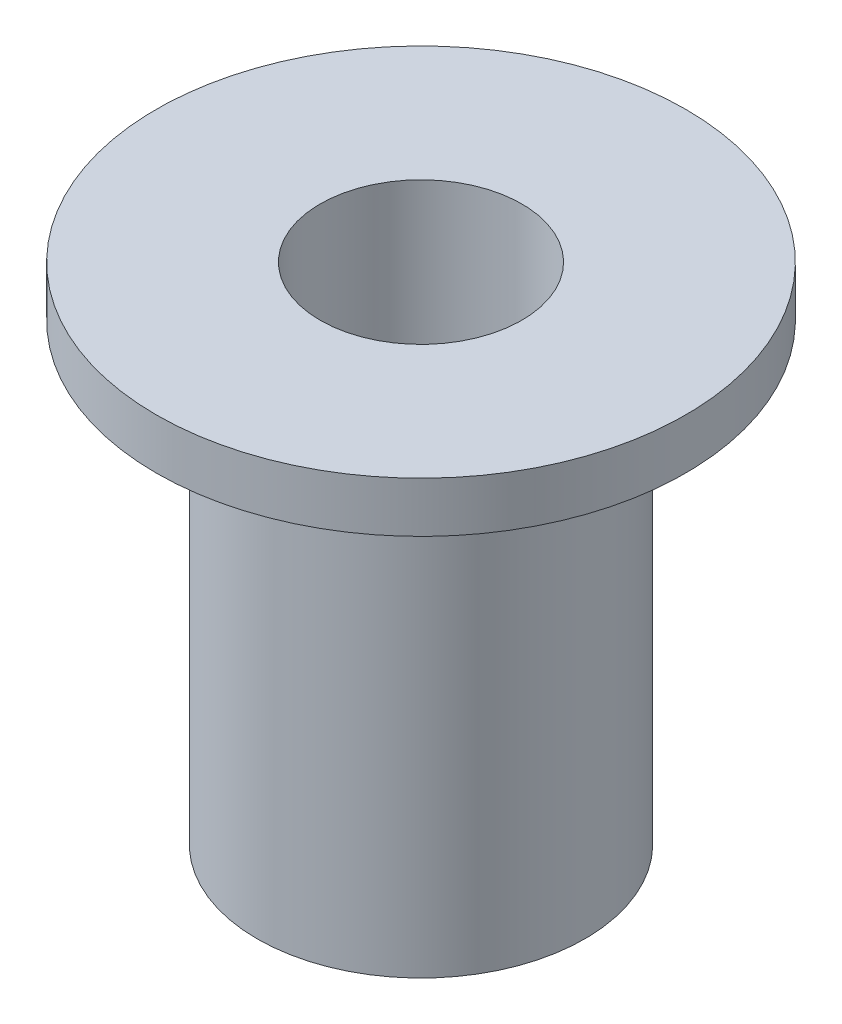
ISO-10303-21;
HEADER;
FILE_DESCRIPTION(('STEP AP214'),'2;1');
FILE_NAME('part.step','',(''),(''),'','','');
FILE_SCHEMA(('AUTOMOTIVE_DESIGN { 1 0 10303 214 1 1 1 1 }'));
ENDSEC;
DATA;
#1=APPLICATION_CONTEXT('core data for automotive mechanical design processes');
#2=APPLICATION_PROTOCOL_DEFINITION('international standard','automotive_design',2000,#1);
#3=PRODUCT_CONTEXT('',#1,'mechanical');
#4=PRODUCT('Part','Part','',(#3));
#5=PRODUCT_RELATED_PRODUCT_CATEGORY('part','',(#4));
#6=PRODUCT_DEFINITION_FORMATION('','',#4);
#7=PRODUCT_DEFINITION_CONTEXT('part definition',#1,'design');
#8=PRODUCT_DEFINITION('design','',#6,#7);
#9=PRODUCT_DEFINITION_SHAPE('','',#8);
#10=(LENGTH_UNIT() NAMED_UNIT(*) SI_UNIT(.MILLI.,.METRE.));
#11=(NAMED_UNIT(*) PLANE_ANGLE_UNIT() SI_UNIT($,.RADIAN.));
#12=(NAMED_UNIT(*) SI_UNIT($,.STERADIAN.) SOLID_ANGLE_UNIT());
#13=UNCERTAINTY_MEASURE_WITH_UNIT(LENGTH_MEASURE(1.E-05),#10,'distance_accuracy_value','');
#14=(GEOMETRIC_REPRESENTATION_CONTEXT(3) GLOBAL_UNCERTAINTY_ASSIGNED_CONTEXT((#13)) GLOBAL_UNIT_ASSIGNED_CONTEXT((#10,
#11,#12)) REPRESENTATION_CONTEXT('',''));
#15=CARTESIAN_POINT('',(0.,0.,0.));
#16=DIRECTION('',(0.,0.,1.));
#17=DIRECTION('',(1.,0.,0.));
#18=AXIS2_PLACEMENT_3D('',#15,#16,#17);
#19=CARTESIAN_POINT('',(0.,20.,0.));
#20=DIRECTION('',(0.,-1.,0.));
#21=DIRECTION('',(0.,0.,-1.));
#22=AXIS2_PLACEMENT_3D('',#19,#20,#21);
#23=CYLINDRICAL_SURFACE('',#22,6.5);
#24=CARTESIAN_POINT('',(0.,0.,0.));
#25=DIRECTION('',(0.,1.,0.));
#26=DIRECTION('',(0.,0.,1.));
#27=AXIS2_PLACEMENT_3D('',#24,#25,#26);
#28=CIRCLE('',#27,6.5);
#29=CARTESIAN_POINT('',(0.,0.,6.5));
#30=VERTEX_POINT('',#29);
#31=EDGE_CURVE('E38',#30,#30,#28,.T.);
#32=ORIENTED_EDGE('',*,*,#31,.T.);
#33=EDGE_LOOP('',(#32));
#34=FACE_BOUND('',#33,.T.);
#35=CARTESIAN_POINT('',(0.,18.,0.));
#36=DIRECTION('',(0.,1.,0.));
#37=DIRECTION('',(0.,0.,1.));
#38=AXIS2_PLACEMENT_3D('',#35,#36,#37);
#39=CIRCLE('',#38,6.5);
#40=CARTESIAN_POINT('',(0.,18.,6.5));
#41=VERTEX_POINT('',#40);
#42=EDGE_CURVE('E11',#41,#41,#39,.T.);
#43=ORIENTED_EDGE('',*,*,#42,.F.);
#44=EDGE_LOOP('',(#43));
#45=FACE_BOUND('',#44,.T.);
#46=ADVANCED_FACE('F32',(#34,#45),#23,.T.);
#47=CARTESIAN_POINT('',(0.,20.,0.));
#48=DIRECTION('',(0.,1.,0.));
#49=DIRECTION('',(0.,0.,1.));
#50=AXIS2_PLACEMENT_3D('',#47,#48,#49);
#51=PLANE('',#50);
#52=CARTESIAN_POINT('',(0.,20.,0.));
#53=DIRECTION('',(0.,1.,0.));
#54=DIRECTION('',(0.,0.,1.));
#55=AXIS2_PLACEMENT_3D('',#52,#53,#54);
#56=CIRCLE('',#55,4.);
#57=CARTESIAN_POINT('',(0.,20.,4.));
#58=VERTEX_POINT('',#57);
#59=EDGE_CURVE('E46',#58,#58,#56,.T.);
#60=ORIENTED_EDGE('',*,*,#59,.F.);
#61=EDGE_LOOP('',(#60));
#62=FACE_BOUND('',#61,.T.);
#63=CARTESIAN_POINT('',(0.,20.,0.));
#64=DIRECTION('',(0.,1.,0.));
#65=DIRECTION('',(0.,0.,1.));
#66=AXIS2_PLACEMENT_3D('',#63,#64,#65);
#67=CIRCLE('',#66,10.5);
#68=CARTESIAN_POINT('',(0.,20.,10.5));
#69=VERTEX_POINT('',#68);
#70=EDGE_CURVE('E58',#69,#69,#67,.T.);
#71=ORIENTED_EDGE('',*,*,#70,.T.);
#72=EDGE_LOOP('',(#71));
#73=FACE_BOUND('',#72,.T.);
#74=ADVANCED_FACE('F76',(#62,#73),#51,.T.);
#75=CARTESIAN_POINT('',(0.,0.,0.));
#76=DIRECTION('',(0.,1.,0.));
#77=DIRECTION('',(0.,0.,1.));
#78=AXIS2_PLACEMENT_3D('',#75,#76,#77);
#79=PLANE('',#78);
#80=CARTESIAN_POINT('',(0.,0.,0.));
#81=DIRECTION('',(0.,1.,0.));
#82=DIRECTION('',(0.,0.,1.));
#83=AXIS2_PLACEMENT_3D('',#80,#81,#82);
#84=CIRCLE('',#83,2.);
#85=CARTESIAN_POINT('',(0.,0.,2.));
#86=VERTEX_POINT('',#85);
#87=EDGE_CURVE('E51',#86,#86,#84,.T.);
#88=ORIENTED_EDGE('',*,*,#87,.T.);
#89=EDGE_LOOP('',(#88));
#90=FACE_BOUND('',#89,.T.);
#91=ORIENTED_EDGE('',*,*,#31,.F.);
#92=EDGE_LOOP('',(#91));
#93=FACE_BOUND('',#92,.T.);
#94=ADVANCED_FACE('F80',(#90,#93),#79,.F.);
#95=CARTESIAN_POINT('',(0.,-11.3137084989848,0.));
#96=DIRECTION('',(0.,1.,0.));
#97=DIRECTION('',(0.,0.,1.));
#98=AXIS2_PLACEMENT_3D('',#95,#96,#97);
#99=CYLINDRICAL_SURFACE('',#98,4.);
#100=CARTESIAN_POINT('',(0.,4.,0.));
#101=DIRECTION('',(0.,1.,0.));
#102=DIRECTION('',(0.,0.,1.));
#103=AXIS2_PLACEMENT_3D('',#100,#101,#102);
#104=CIRCLE('',#103,4.);
#105=CARTESIAN_POINT('',(0.,4.,4.));
#106=VERTEX_POINT('',#105);
#107=EDGE_CURVE('E42',#106,#106,#104,.F.);
#108=ORIENTED_EDGE('',*,*,#107,.T.);
#109=EDGE_LOOP('',(#108));
#110=FACE_BOUND('',#109,.T.);
#111=ORIENTED_EDGE('',*,*,#59,.T.);
#112=EDGE_LOOP('',(#111));
#113=FACE_BOUND('',#112,.T.);
#114=ADVANCED_FACE('F87',(#110,#113),#99,.F.);
#115=CARTESIAN_POINT('',(0.,4.,0.));
#116=DIRECTION('',(0.,1.,0.));
#117=DIRECTION('',(0.,0.,1.));
#118=AXIS2_PLACEMENT_3D('',#115,#116,#117);
#119=PLANE('',#118);
#120=CARTESIAN_POINT('',(0.,4.,0.));
#121=DIRECTION('',(0.,1.,0.));
#122=DIRECTION('',(0.,0.,1.));
#123=AXIS2_PLACEMENT_3D('',#120,#121,#122);
#124=CIRCLE('',#123,2.);
#125=CARTESIAN_POINT('',(0.,4.,2.));
#126=VERTEX_POINT('',#125);
#127=EDGE_CURVE('E52',#126,#126,#124,.T.);
#128=ORIENTED_EDGE('',*,*,#127,.F.);
#129=EDGE_LOOP('',(#128));
#130=FACE_BOUND('',#129,.T.);
#131=ORIENTED_EDGE('',*,*,#107,.F.);
#132=EDGE_LOOP('',(#131));
#133=FACE_BOUND('',#132,.T.);
#134=ADVANCED_FACE('F94',(#130,#133),#119,.T.);
#135=CARTESIAN_POINT('',(0.,0.,0.));
#136=DIRECTION('',(0.,1.,0.));
#137=DIRECTION('',(0.,0.,1.));
#138=AXIS2_PLACEMENT_3D('',#135,#136,#137);
#139=CYLINDRICAL_SURFACE('',#138,2.);
#140=ORIENTED_EDGE('',*,*,#87,.F.);
#141=EDGE_LOOP('',(#140));
#142=FACE_BOUND('',#141,.T.);
#143=ORIENTED_EDGE('',*,*,#127,.T.);
#144=EDGE_LOOP('',(#143));
#145=FACE_BOUND('',#144,.T.);
#146=ADVANCED_FACE('F73',(#142,#145),#139,.F.);
#147=CARTESIAN_POINT('',(0.,18.,0.));
#148=DIRECTION('',(0.,1.,0.));
#149=DIRECTION('',(0.,0.,1.));
#150=AXIS2_PLACEMENT_3D('',#147,#148,#149);
#151=CYLINDRICAL_SURFACE('',#150,10.5);
#152=CARTESIAN_POINT('',(0.,18.,0.));
#153=DIRECTION('',(0.,1.,0.));
#154=DIRECTION('',(0.,0.,1.));
#155=AXIS2_PLACEMENT_3D('',#152,#153,#154);
#156=CIRCLE('',#155,10.5);
#157=CARTESIAN_POINT('',(0.,18.,10.5));
#158=VERTEX_POINT('',#157);
#159=EDGE_CURVE('E55',#158,#158,#156,.T.);
#160=ORIENTED_EDGE('',*,*,#159,.T.);
#161=EDGE_LOOP('',(#160));
#162=FACE_BOUND('',#161,.T.);
#163=ORIENTED_EDGE('',*,*,#70,.F.);
#164=EDGE_LOOP('',(#163));
#165=FACE_BOUND('',#164,.T.);
#166=ADVANCED_FACE('F64',(#162,#165),#151,.T.);
#167=CARTESIAN_POINT('',(0.,18.,0.));
#168=DIRECTION('',(0.,1.,0.));
#169=DIRECTION('',(0.,0.,1.));
#170=AXIS2_PLACEMENT_3D('',#167,#168,#169);
#171=PLANE('',#170);
#172=ORIENTED_EDGE('',*,*,#42,.T.);
#173=EDGE_LOOP('',(#172));
#174=FACE_BOUND('',#173,.T.);
#175=ORIENTED_EDGE('',*,*,#159,.F.);
#176=EDGE_LOOP('',(#175));
#177=FACE_BOUND('',#176,.T.);
#178=ADVANCED_FACE('F67',(#174,#177),#171,.F.);
#179=CLOSED_SHELL('',(#46,#74,#94,#114,#134,#146,#166,#178));
#180=MANIFOLD_SOLID_BREP('B2',#179);
#181=ADVANCED_BREP_SHAPE_REPRESENTATION('',(#18,#180),#14);
#182=SHAPE_DEFINITION_REPRESENTATION(#9,#181);
ENDSEC;
END-ISO-10303-21;
